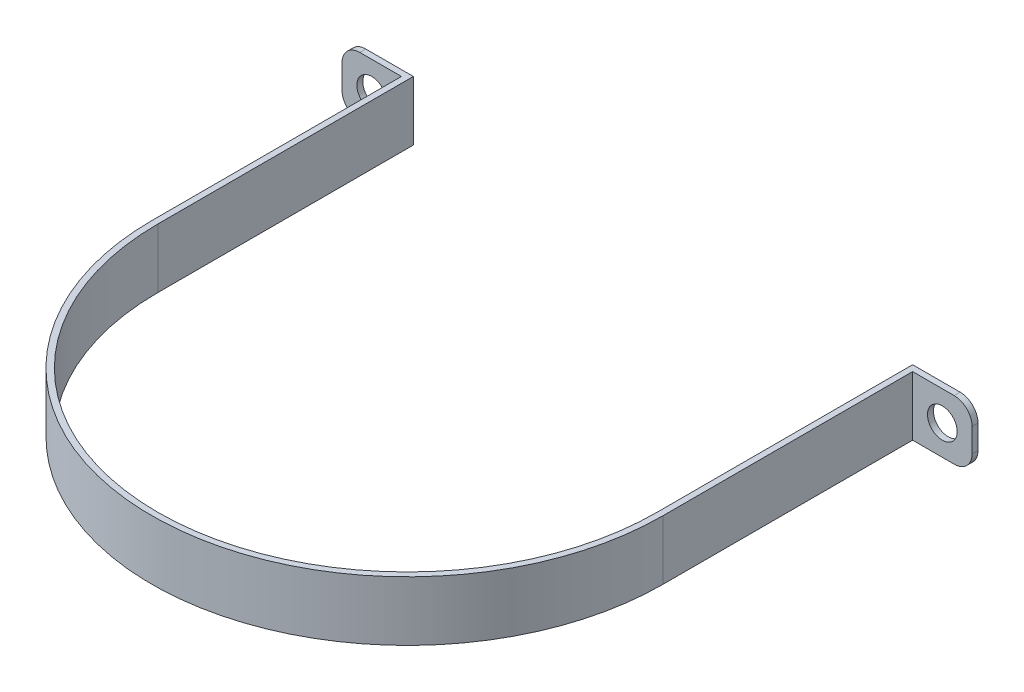
ISO-10303-21;
HEADER;
FILE_DESCRIPTION(('STEP AP214'),'2;1');
FILE_NAME('part.step','',(''),(''),'','','');
FILE_SCHEMA(('AUTOMOTIVE_DESIGN { 1 0 10303 214 1 1 1 1 }'));
ENDSEC;
DATA;
#1=APPLICATION_CONTEXT('core data for automotive mechanical design processes');
#2=APPLICATION_PROTOCOL_DEFINITION('international standard','automotive_design',2000,#1);
#3=PRODUCT_CONTEXT('',#1,'mechanical');
#4=PRODUCT('Part','Part','',(#3));
#5=PRODUCT_RELATED_PRODUCT_CATEGORY('part','',(#4));
#6=PRODUCT_DEFINITION_FORMATION('','',#4);
#7=PRODUCT_DEFINITION_CONTEXT('part definition',#1,'design');
#8=PRODUCT_DEFINITION('design','',#6,#7);
#9=PRODUCT_DEFINITION_SHAPE('','',#8);
#10=(LENGTH_UNIT() NAMED_UNIT(*) SI_UNIT(.MILLI.,.METRE.));
#11=(NAMED_UNIT(*) PLANE_ANGLE_UNIT() SI_UNIT($,.RADIAN.));
#12=(NAMED_UNIT(*) SI_UNIT($,.STERADIAN.) SOLID_ANGLE_UNIT());
#13=UNCERTAINTY_MEASURE_WITH_UNIT(LENGTH_MEASURE(1.E-05),#10,'distance_accuracy_value','');
#14=(GEOMETRIC_REPRESENTATION_CONTEXT(3) GLOBAL_UNCERTAINTY_ASSIGNED_CONTEXT((#13)) GLOBAL_UNIT_ASSIGNED_CONTEXT((#10,
#11,#12)) REPRESENTATION_CONTEXT('',''));
#15=CARTESIAN_POINT('',(0.,0.,0.));
#16=DIRECTION('',(0.,0.,1.));
#17=DIRECTION('',(1.,0.,0.));
#18=AXIS2_PLACEMENT_3D('',#15,#16,#17);
#19=CARTESIAN_POINT('',(-43.,10.,0.));
#20=DIRECTION('',(1.,0.,0.));
#21=DIRECTION('',(0.,0.,-1.));
#22=AXIS2_PLACEMENT_3D('',#19,#20,#21);
#23=PLANE('',#22);
#24=DIRECTION('',(0.,1.,0.));
#25=VECTOR('',#24,1.);
#26=CARTESIAN_POINT('',(-43.,10.,-42.));
#27=LINE('',#26,#25);
#28=CARTESIAN_POINT('',(-43.,0.,-42.));
#29=VERTEX_POINT('',#28);
#30=CARTESIAN_POINT('',(-43.,10.,-42.));
#31=VERTEX_POINT('',#30);
#32=EDGE_CURVE('E152',#29,#31,#27,.T.);
#33=ORIENTED_EDGE('',*,*,#32,.F.);
#34=DIRECTION('',(0.,0.,1.));
#35=VECTOR('',#34,1.);
#36=CARTESIAN_POINT('',(-43.,0.,0.));
#37=LINE('',#36,#35);
#38=CARTESIAN_POINT('',(-43.,0.,0.));
#39=VERTEX_POINT('',#38);
#40=EDGE_CURVE('E160',#29,#39,#37,.T.);
#41=ORIENTED_EDGE('',*,*,#40,.T.);
#42=DIRECTION('',(0.,-1.,0.));
#43=VECTOR('',#42,1.);
#44=CARTESIAN_POINT('',(-43.,10.,0.));
#45=LINE('',#44,#43);
#46=CARTESIAN_POINT('',(-43.,10.,0.));
#47=VERTEX_POINT('',#46);
#48=EDGE_CURVE('E239',#47,#39,#45,.T.);
#49=ORIENTED_EDGE('',*,*,#48,.F.);
#50=DIRECTION('',(0.,0.,1.));
#51=VECTOR('',#50,1.);
#52=CARTESIAN_POINT('',(-43.,10.,0.));
#53=LINE('',#52,#51);
#54=EDGE_CURVE('E169',#31,#47,#53,.T.);
#55=ORIENTED_EDGE('',*,*,#54,.F.);
#56=EDGE_LOOP('',(#33,#41,#49,#55));
#57=FACE_BOUND('',#56,.T.);
#58=ADVANCED_FACE('F34',(#57),#23,.F.);
#59=CARTESIAN_POINT('',(43.,10.,0.));
#60=DIRECTION('',(-1.,0.,0.));
#61=DIRECTION('',(0.,0.,1.));
#62=AXIS2_PLACEMENT_3D('',#59,#60,#61);
#63=PLANE('',#62);
#64=DIRECTION('',(0.,1.,0.));
#65=VECTOR('',#64,1.);
#66=CARTESIAN_POINT('',(43.,10.,-42.));
#67=LINE('',#66,#65);
#68=CARTESIAN_POINT('',(43.,0.,-42.));
#69=VERTEX_POINT('',#68);
#70=CARTESIAN_POINT('',(43.,10.,-42.));
#71=VERTEX_POINT('',#70);
#72=EDGE_CURVE('E189',#69,#71,#67,.T.);
#73=ORIENTED_EDGE('',*,*,#72,.T.);
#74=DIRECTION('',(0.,0.,-1.));
#75=VECTOR('',#74,1.);
#76=CARTESIAN_POINT('',(43.,10.,0.));
#77=LINE('',#76,#75);
#78=CARTESIAN_POINT('',(43.,10.,0.));
#79=VERTEX_POINT('',#78);
#80=EDGE_CURVE('E216',#79,#71,#77,.T.);
#81=ORIENTED_EDGE('',*,*,#80,.F.);
#82=DIRECTION('',(0.,-1.,0.));
#83=VECTOR('',#82,1.);
#84=CARTESIAN_POINT('',(43.,10.,0.));
#85=LINE('',#84,#83);
#86=CARTESIAN_POINT('',(43.,0.,0.));
#87=VERTEX_POINT('',#86);
#88=EDGE_CURVE('E236',#79,#87,#85,.T.);
#89=ORIENTED_EDGE('',*,*,#88,.T.);
#90=DIRECTION('',(0.,0.,-1.));
#91=VECTOR('',#90,1.);
#92=CARTESIAN_POINT('',(43.,0.,0.));
#93=LINE('',#92,#91);
#94=EDGE_CURVE('E230',#87,#69,#93,.T.);
#95=ORIENTED_EDGE('',*,*,#94,.T.);
#96=EDGE_LOOP('',(#73,#81,#89,#95));
#97=FACE_BOUND('',#96,.T.);
#98=ADVANCED_FACE('F326',(#97),#63,.F.);
#99=CARTESIAN_POINT('',(42.,10.,-43.));
#100=DIRECTION('',(1.,0.,0.));
#101=DIRECTION('',(0.,0.,-1.));
#102=AXIS2_PLACEMENT_3D('',#99,#100,#101);
#103=PLANE('',#102);
#104=DIRECTION('',(0.,0.,1.));
#105=VECTOR('',#104,1.);
#106=CARTESIAN_POINT('',(42.,0.,-43.));
#107=LINE('',#106,#105);
#108=CARTESIAN_POINT('',(42.,0.,-43.));
#109=VERTEX_POINT('',#108);
#110=CARTESIAN_POINT('',(42.,0.,0.));
#111=VERTEX_POINT('',#110);
#112=EDGE_CURVE('E199',#109,#111,#107,.T.);
#113=ORIENTED_EDGE('',*,*,#112,.T.);
#114=DIRECTION('',(0.,-1.,0.));
#115=VECTOR('',#114,1.);
#116=CARTESIAN_POINT('',(42.,10.,0.));
#117=LINE('',#116,#115);
#118=CARTESIAN_POINT('',(42.,10.,0.));
#119=VERTEX_POINT('',#118);
#120=EDGE_CURVE('E247',#119,#111,#117,.T.);
#121=ORIENTED_EDGE('',*,*,#120,.F.);
#122=DIRECTION('',(0.,0.,1.));
#123=VECTOR('',#122,1.);
#124=CARTESIAN_POINT('',(42.,10.,-43.));
#125=LINE('',#124,#123);
#126=CARTESIAN_POINT('',(42.,10.,-43.));
#127=VERTEX_POINT('',#126);
#128=EDGE_CURVE('E202',#127,#119,#125,.T.);
#129=ORIENTED_EDGE('',*,*,#128,.F.);
#130=DIRECTION('',(0.,-1.,0.));
#131=VECTOR('',#130,1.);
#132=CARTESIAN_POINT('',(42.,10.,-43.));
#133=LINE('',#132,#131);
#134=EDGE_CURVE('E221',#127,#109,#133,.T.);
#135=ORIENTED_EDGE('',*,*,#134,.T.);
#136=EDGE_LOOP('',(#113,#121,#129,#135));
#137=FACE_BOUND('',#136,.T.);
#138=ADVANCED_FACE('F296',(#137),#103,.F.);
#139=CARTESIAN_POINT('',(0.,10.,0.));
#140=DIRECTION('',(0.,-1.,0.));
#141=DIRECTION('',(0.,0.,-1.));
#142=AXIS2_PLACEMENT_3D('',#139,#140,#141);
#143=CYLINDRICAL_SURFACE('',#142,42.);
#144=CARTESIAN_POINT('',(0.,0.,0.));
#145=DIRECTION('',(0.,-1.,0.));
#146=DIRECTION('',(0.,0.,1.));
#147=AXIS2_PLACEMENT_3D('',#144,#145,#146);
#148=CIRCLE('',#147,42.);
#149=CARTESIAN_POINT('',(-42.,0.,0.));
#150=VERTEX_POINT('',#149);
#151=EDGE_CURVE('E224',#111,#150,#148,.T.);
#152=ORIENTED_EDGE('',*,*,#151,.T.);
#153=DIRECTION('',(0.,-1.,0.));
#154=VECTOR('',#153,1.);
#155=CARTESIAN_POINT('',(-42.,10.,0.));
#156=LINE('',#155,#154);
#157=CARTESIAN_POINT('',(-42.,10.,0.));
#158=VERTEX_POINT('',#157);
#159=EDGE_CURVE('E244',#158,#150,#156,.T.);
#160=ORIENTED_EDGE('',*,*,#159,.F.);
#161=CARTESIAN_POINT('',(0.,10.,0.));
#162=DIRECTION('',(0.,-1.,0.));
#163=DIRECTION('',(0.,0.,1.));
#164=AXIS2_PLACEMENT_3D('',#161,#162,#163);
#165=CIRCLE('',#164,42.);
#166=EDGE_CURVE('E205',#119,#158,#165,.T.);
#167=ORIENTED_EDGE('',*,*,#166,.F.);
#168=ORIENTED_EDGE('',*,*,#120,.T.);
#169=EDGE_LOOP('',(#152,#160,#167,#168));
#170=FACE_BOUND('',#169,.T.);
#171=ADVANCED_FACE('F293',(#170),#143,.F.);
#172=CARTESIAN_POINT('',(-42.,10.,0.));
#173=DIRECTION('',(-1.,0.,0.));
#174=DIRECTION('',(0.,0.,1.));
#175=AXIS2_PLACEMENT_3D('',#172,#173,#174);
#176=PLANE('',#175);
#177=DIRECTION('',(0.,0.,-1.));
#178=VECTOR('',#177,1.);
#179=CARTESIAN_POINT('',(-42.,0.,0.));
#180=LINE('',#179,#178);
#181=CARTESIAN_POINT('',(-42.,0.,-43.));
#182=VERTEX_POINT('',#181);
#183=EDGE_CURVE('E226',#150,#182,#180,.T.);
#184=ORIENTED_EDGE('',*,*,#183,.T.);
#185=DIRECTION('',(0.,-1.,0.));
#186=VECTOR('',#185,1.);
#187=CARTESIAN_POINT('',(-42.,10.,-43.));
#188=LINE('',#187,#186);
#189=CARTESIAN_POINT('',(-42.,10.,-43.));
#190=VERTEX_POINT('',#189);
#191=EDGE_CURVE('E241',#190,#182,#188,.T.);
#192=ORIENTED_EDGE('',*,*,#191,.F.);
#193=DIRECTION('',(0.,0.,-1.));
#194=VECTOR('',#193,1.);
#195=CARTESIAN_POINT('',(-42.,10.,0.));
#196=LINE('',#195,#194);
#197=EDGE_CURVE('E208',#158,#190,#196,.T.);
#198=ORIENTED_EDGE('',*,*,#197,.F.);
#199=ORIENTED_EDGE('',*,*,#159,.T.);
#200=EDGE_LOOP('',(#184,#192,#198,#199));
#201=FACE_BOUND('',#200,.T.);
#202=ADVANCED_FACE('F287',(#201),#176,.F.);
#203=CARTESIAN_POINT('',(-43.,10.,-43.));
#204=DIRECTION('',(0.,0.,1.));
#205=DIRECTION('',(1.,0.,0.));
#206=AXIS2_PLACEMENT_3D('',#203,#204,#205);
#207=PLANE('',#206);
#208=CARTESIAN_POINT('',(-48.,5.,-43.));
#209=DIRECTION('',(0.,0.,1.));
#210=DIRECTION('',(1.,0.,0.));
#211=AXIS2_PLACEMENT_3D('',#208,#209,#210);
#212=CIRCLE('',#211,2.5);
#213=CARTESIAN_POINT('',(-45.5,5.,-43.));
#214=VERTEX_POINT('',#213);
#215=EDGE_CURVE('E176',#214,#214,#212,.T.);
#216=ORIENTED_EDGE('',*,*,#215,.T.);
#217=EDGE_LOOP('',(#216));
#218=FACE_BOUND('',#217,.T.);
#219=DIRECTION('',(-1.,0.,0.));
#220=VECTOR('',#219,1.);
#221=CARTESIAN_POINT('',(-43.,0.,-43.));
#222=LINE('',#221,#220);
#223=CARTESIAN_POINT('',(-50.,0.,-43.));
#224=VERTEX_POINT('',#223);
#225=EDGE_CURVE('E167',#182,#224,#222,.T.);
#226=ORIENTED_EDGE('',*,*,#225,.T.);
#227=CARTESIAN_POINT('',(-50.,3.,-43.));
#228=DIRECTION('',(0.,0.,1.));
#229=DIRECTION('',(1.,0.,0.));
#230=AXIS2_PLACEMENT_3D('',#227,#228,#229);
#231=CIRCLE('',#230,3.);
#232=CARTESIAN_POINT('',(-53.,3.,-43.));
#233=VERTEX_POINT('',#232);
#234=EDGE_CURVE('E56',#224,#233,#231,.F.);
#235=ORIENTED_EDGE('',*,*,#234,.T.);
#236=DIRECTION('',(0.,-1.,0.));
#237=VECTOR('',#236,1.);
#238=CARTESIAN_POINT('',(-53.,10.,-43.));
#239=LINE('',#238,#237);
#240=CARTESIAN_POINT('',(-53.,7.,-43.));
#241=VERTEX_POINT('',#240);
#242=EDGE_CURVE('E171',#241,#233,#239,.T.);
#243=ORIENTED_EDGE('',*,*,#242,.F.);
#244=CARTESIAN_POINT('',(-50.,7.,-43.));
#245=DIRECTION('',(0.,0.,1.));
#246=DIRECTION('',(1.,0.,0.));
#247=AXIS2_PLACEMENT_3D('',#244,#245,#246);
#248=CIRCLE('',#247,3.);
#249=CARTESIAN_POINT('',(-50.,10.,-43.));
#250=VERTEX_POINT('',#249);
#251=EDGE_CURVE('E271',#241,#250,#248,.F.);
#252=ORIENTED_EDGE('',*,*,#251,.T.);
#253=DIRECTION('',(-1.,0.,0.));
#254=VECTOR('',#253,1.);
#255=CARTESIAN_POINT('',(-43.,10.,-43.));
#256=LINE('',#255,#254);
#257=EDGE_CURVE('E210',#190,#250,#256,.T.);
#258=ORIENTED_EDGE('',*,*,#257,.F.);
#259=ORIENTED_EDGE('',*,*,#191,.T.);
#260=EDGE_LOOP('',(#226,#235,#243,#252,#258,#259));
#261=FACE_BOUND('',#260,.T.);
#262=ADVANCED_FACE('F282',(#218,#261),#207,.F.);
#263=CARTESIAN_POINT('',(0.,10.,0.));
#264=DIRECTION('',(0.,-1.,0.));
#265=DIRECTION('',(0.,0.,-1.));
#266=AXIS2_PLACEMENT_3D('',#263,#264,#265);
#267=CYLINDRICAL_SURFACE('',#266,43.);
#268=CARTESIAN_POINT('',(0.,0.,0.));
#269=DIRECTION('',(0.,1.,0.));
#270=DIRECTION('',(0.,0.,1.));
#271=AXIS2_PLACEMENT_3D('',#268,#269,#270);
#272=CIRCLE('',#271,43.);
#273=EDGE_CURVE('E163',#39,#87,#272,.T.);
#274=ORIENTED_EDGE('',*,*,#273,.T.);
#275=ORIENTED_EDGE('',*,*,#88,.F.);
#276=CARTESIAN_POINT('',(0.,10.,0.));
#277=DIRECTION('',(0.,1.,0.));
#278=DIRECTION('',(0.,0.,1.));
#279=AXIS2_PLACEMENT_3D('',#276,#277,#278);
#280=CIRCLE('',#279,43.);
#281=EDGE_CURVE('E214',#47,#79,#280,.T.);
#282=ORIENTED_EDGE('',*,*,#281,.F.);
#283=ORIENTED_EDGE('',*,*,#48,.T.);
#284=EDGE_LOOP('',(#274,#275,#282,#283));
#285=FACE_BOUND('',#284,.T.);
#286=ADVANCED_FACE('F328',(#285),#267,.T.);
#287=CARTESIAN_POINT('',(42.,10.,-43.));
#288=DIRECTION('',(0.,0.,1.));
#289=DIRECTION('',(1.,0.,0.));
#290=AXIS2_PLACEMENT_3D('',#287,#288,#289);
#291=PLANE('',#290);
#292=CARTESIAN_POINT('',(48.,5.,-43.));
#293=DIRECTION('',(0.,0.,-1.));
#294=DIRECTION('',(-1.,0.,0.));
#295=AXIS2_PLACEMENT_3D('',#292,#293,#294);
#296=CIRCLE('',#295,2.5);
#297=CARTESIAN_POINT('',(45.5,5.,-43.));
#298=VERTEX_POINT('',#297);
#299=EDGE_CURVE('E181',#298,#298,#296,.T.);
#300=ORIENTED_EDGE('',*,*,#299,.F.);
#301=EDGE_LOOP('',(#300));
#302=FACE_BOUND('',#301,.T.);
#303=DIRECTION('',(0.,-1.,0.));
#304=VECTOR('',#303,1.);
#305=CARTESIAN_POINT('',(53.,10.,-43.));
#306=LINE('',#305,#304);
#307=CARTESIAN_POINT('',(53.,7.,-43.));
#308=VERTEX_POINT('',#307);
#309=CARTESIAN_POINT('',(53.,3.,-43.));
#310=VERTEX_POINT('',#309);
#311=EDGE_CURVE('E186',#308,#310,#306,.T.);
#312=ORIENTED_EDGE('',*,*,#311,.T.);
#313=CARTESIAN_POINT('',(50.,3.,-43.));
#314=DIRECTION('',(0.,0.,1.));
#315=DIRECTION('',(1.,0.,0.));
#316=AXIS2_PLACEMENT_3D('',#313,#314,#315);
#317=CIRCLE('',#316,3.);
#318=CARTESIAN_POINT('',(50.,0.,-43.));
#319=VERTEX_POINT('',#318);
#320=EDGE_CURVE('E262',#310,#319,#317,.F.);
#321=ORIENTED_EDGE('',*,*,#320,.T.);
#322=DIRECTION('',(-1.,0.,0.));
#323=VECTOR('',#322,1.);
#324=CARTESIAN_POINT('',(42.,0.,-43.));
#325=LINE('',#324,#323);
#326=EDGE_CURVE('E206',#319,#109,#325,.T.);
#327=ORIENTED_EDGE('',*,*,#326,.T.);
#328=ORIENTED_EDGE('',*,*,#134,.F.);
#329=DIRECTION('',(-1.,0.,0.));
#330=VECTOR('',#329,1.);
#331=CARTESIAN_POINT('',(42.,10.,-43.));
#332=LINE('',#331,#330);
#333=CARTESIAN_POINT('',(50.,10.,-43.));
#334=VERTEX_POINT('',#333);
#335=EDGE_CURVE('E219',#334,#127,#332,.T.);
#336=ORIENTED_EDGE('',*,*,#335,.F.);
#337=CARTESIAN_POINT('',(50.,7.,-43.));
#338=DIRECTION('',(0.,0.,1.));
#339=DIRECTION('',(1.,0.,0.));
#340=AXIS2_PLACEMENT_3D('',#337,#338,#339);
#341=CIRCLE('',#340,3.);
#342=EDGE_CURVE('E253',#334,#308,#341,.F.);
#343=ORIENTED_EDGE('',*,*,#342,.T.);
#344=EDGE_LOOP('',(#312,#321,#327,#328,#336,#343));
#345=FACE_BOUND('',#344,.T.);
#346=ADVANCED_FACE('F300',(#302,#345),#291,.F.);
#347=CARTESIAN_POINT('',(0.,10.,0.));
#348=DIRECTION('',(0.,1.,0.));
#349=DIRECTION('',(0.,0.,1.));
#350=AXIS2_PLACEMENT_3D('',#347,#348,#349);
#351=PLANE('',#350);
#352=ORIENTED_EDGE('',*,*,#257,.T.);
#353=DIRECTION('',(0.,0.,-1.));
#354=VECTOR('',#353,1.);
#355=CARTESIAN_POINT('',(-50.,10.,-42.));
#356=LINE('',#355,#354);
#357=CARTESIAN_POINT('',(-50.,10.,-42.));
#358=VERTEX_POINT('',#357);
#359=EDGE_CURVE('E273',#250,#358,#356,.F.);
#360=ORIENTED_EDGE('',*,*,#359,.T.);
#361=DIRECTION('',(-1.,0.,0.));
#362=VECTOR('',#361,1.);
#363=CARTESIAN_POINT('',(-43.,10.,-42.));
#364=LINE('',#363,#362);
#365=EDGE_CURVE('E180',#31,#358,#364,.T.);
#366=ORIENTED_EDGE('',*,*,#365,.F.);
#367=ORIENTED_EDGE('',*,*,#54,.T.);
#368=ORIENTED_EDGE('',*,*,#281,.T.);
#369=ORIENTED_EDGE('',*,*,#80,.T.);
#370=DIRECTION('',(1.,0.,0.));
#371=VECTOR('',#370,1.);
#372=CARTESIAN_POINT('',(43.,10.,-42.));
#373=LINE('',#372,#371);
#374=CARTESIAN_POINT('',(50.,10.,-42.));
#375=VERTEX_POINT('',#374);
#376=EDGE_CURVE('E191',#71,#375,#373,.T.);
#377=ORIENTED_EDGE('',*,*,#376,.T.);
#378=DIRECTION('',(0.,0.,-1.));
#379=VECTOR('',#378,1.);
#380=CARTESIAN_POINT('',(50.,10.,0.));
#381=LINE('',#380,#379);
#382=EDGE_CURVE('E250',#375,#334,#381,.T.);
#383=ORIENTED_EDGE('',*,*,#382,.T.);
#384=ORIENTED_EDGE('',*,*,#335,.T.);
#385=ORIENTED_EDGE('',*,*,#128,.T.);
#386=ORIENTED_EDGE('',*,*,#166,.T.);
#387=ORIENTED_EDGE('',*,*,#197,.T.);
#388=EDGE_LOOP('',(#352,#360,#366,#367,#368,#369,#377,#383,#384,#385,#386,#387));
#389=FACE_BOUND('',#388,.T.);
#390=ADVANCED_FACE('F321',(#389),#351,.T.);
#391=CARTESIAN_POINT('',(0.,0.,0.));
#392=DIRECTION('',(0.,1.,0.));
#393=DIRECTION('',(0.,0.,1.));
#394=AXIS2_PLACEMENT_3D('',#391,#392,#393);
#395=PLANE('',#394);
#396=DIRECTION('',(1.,0.,0.));
#397=VECTOR('',#396,1.);
#398=CARTESIAN_POINT('',(-53.,0.,-42.));
#399=LINE('',#398,#397);
#400=CARTESIAN_POINT('',(-50.,0.,-42.));
#401=VERTEX_POINT('',#400);
#402=EDGE_CURVE('E147',#401,#29,#399,.T.);
#403=ORIENTED_EDGE('',*,*,#402,.F.);
#404=DIRECTION('',(0.,0.,-1.));
#405=VECTOR('',#404,1.);
#406=CARTESIAN_POINT('',(-50.,0.,0.));
#407=LINE('',#406,#405);
#408=EDGE_CURVE('E277',#401,#224,#407,.T.);
#409=ORIENTED_EDGE('',*,*,#408,.T.);
#410=ORIENTED_EDGE('',*,*,#225,.F.);
#411=ORIENTED_EDGE('',*,*,#183,.F.);
#412=ORIENTED_EDGE('',*,*,#151,.F.);
#413=ORIENTED_EDGE('',*,*,#112,.F.);
#414=ORIENTED_EDGE('',*,*,#326,.F.);
#415=DIRECTION('',(0.,0.,-1.));
#416=VECTOR('',#415,1.);
#417=CARTESIAN_POINT('',(50.,0.,-42.));
#418=LINE('',#417,#416);
#419=CARTESIAN_POINT('',(50.,0.,-42.));
#420=VERTEX_POINT('',#419);
#421=EDGE_CURVE('E264',#319,#420,#418,.F.);
#422=ORIENTED_EDGE('',*,*,#421,.T.);
#423=DIRECTION('',(-1.,0.,0.));
#424=VECTOR('',#423,1.);
#425=CARTESIAN_POINT('',(53.,0.,-42.));
#426=LINE('',#425,#424);
#427=EDGE_CURVE('E197',#420,#69,#426,.T.);
#428=ORIENTED_EDGE('',*,*,#427,.T.);
#429=ORIENTED_EDGE('',*,*,#94,.F.);
#430=ORIENTED_EDGE('',*,*,#273,.F.);
#431=ORIENTED_EDGE('',*,*,#40,.F.);
#432=EDGE_LOOP('',(#403,#409,#410,#411,#412,#413,#414,#422,#428,#429,#430,#431));
#433=FACE_BOUND('',#432,.T.);
#434=ADVANCED_FACE('F161',(#433),#395,.F.);
#435=CARTESIAN_POINT('',(53.,10.,-42.));
#436=DIRECTION('',(1.,0.,0.));
#437=DIRECTION('',(0.,0.,-1.));
#438=AXIS2_PLACEMENT_3D('',#435,#436,#437);
#439=PLANE('',#438);
#440=DIRECTION('',(0.,-1.,0.));
#441=VECTOR('',#440,1.);
#442=CARTESIAN_POINT('',(53.,10.,-42.));
#443=LINE('',#442,#441);
#444=CARTESIAN_POINT('',(53.,7.,-42.));
#445=VERTEX_POINT('',#444);
#446=CARTESIAN_POINT('',(53.,3.,-42.));
#447=VERTEX_POINT('',#446);
#448=EDGE_CURVE('E194',#445,#447,#443,.T.);
#449=ORIENTED_EDGE('',*,*,#448,.T.);
#450=DIRECTION('',(0.,0.,-1.));
#451=VECTOR('',#450,1.);
#452=CARTESIAN_POINT('',(53.,3.,-43.));
#453=LINE('',#452,#451);
#454=EDGE_CURVE('E259',#447,#310,#453,.T.);
#455=ORIENTED_EDGE('',*,*,#454,.T.);
#456=ORIENTED_EDGE('',*,*,#311,.F.);
#457=DIRECTION('',(0.,0.,-1.));
#458=VECTOR('',#457,1.);
#459=CARTESIAN_POINT('',(53.,7.,-42.));
#460=LINE('',#459,#458);
#461=EDGE_CURVE('E255',#308,#445,#460,.F.);
#462=ORIENTED_EDGE('',*,*,#461,.T.);
#463=EDGE_LOOP('',(#449,#455,#456,#462));
#464=FACE_BOUND('',#463,.T.);
#465=ADVANCED_FACE('F313',(#464),#439,.T.);
#466=CARTESIAN_POINT('',(0.,0.,-42.));
#467=DIRECTION('',(0.,0.,-1.));
#468=DIRECTION('',(-1.,0.,0.));
#469=AXIS2_PLACEMENT_3D('',#466,#467,#468);
#470=PLANE('',#469);
#471=CARTESIAN_POINT('',(48.,5.,-42.));
#472=DIRECTION('',(0.,0.,-1.));
#473=DIRECTION('',(-1.,0.,0.));
#474=AXIS2_PLACEMENT_3D('',#471,#472,#473);
#475=CIRCLE('',#474,2.5);
#476=CARTESIAN_POINT('',(45.5,5.,-42.));
#477=VERTEX_POINT('',#476);
#478=EDGE_CURVE('E183',#477,#477,#475,.T.);
#479=ORIENTED_EDGE('',*,*,#478,.T.);
#480=EDGE_LOOP('',(#479));
#481=FACE_BOUND('',#480,.T.);
#482=ORIENTED_EDGE('',*,*,#427,.F.);
#483=CARTESIAN_POINT('',(50.,3.,-42.));
#484=DIRECTION('',(0.,0.,-1.));
#485=DIRECTION('',(-1.,0.,0.));
#486=AXIS2_PLACEMENT_3D('',#483,#484,#485);
#487=CIRCLE('',#486,3.);
#488=EDGE_CURVE('E266',#420,#447,#487,.F.);
#489=ORIENTED_EDGE('',*,*,#488,.T.);
#490=ORIENTED_EDGE('',*,*,#448,.F.);
#491=CARTESIAN_POINT('',(50.,7.,-42.));
#492=DIRECTION('',(0.,0.,-1.));
#493=DIRECTION('',(-1.,0.,0.));
#494=AXIS2_PLACEMENT_3D('',#491,#492,#493);
#495=CIRCLE('',#494,3.);
#496=EDGE_CURVE('E257',#445,#375,#495,.F.);
#497=ORIENTED_EDGE('',*,*,#496,.T.);
#498=ORIENTED_EDGE('',*,*,#376,.F.);
#499=ORIENTED_EDGE('',*,*,#72,.F.);
#500=EDGE_LOOP('',(#482,#489,#490,#497,#498,#499));
#501=FACE_BOUND('',#500,.T.);
#502=ADVANCED_FACE('F309',(#481,#501),#470,.F.);
#503=CARTESIAN_POINT('',(50.,7.,0.));
#504=DIRECTION('',(0.,0.,-1.));
#505=DIRECTION('',(-1.,0.,0.));
#506=AXIS2_PLACEMENT_3D('',#503,#504,#505);
#507=CYLINDRICAL_SURFACE('',#506,3.);
#508=ORIENTED_EDGE('',*,*,#496,.F.);
#509=ORIENTED_EDGE('',*,*,#461,.F.);
#510=ORIENTED_EDGE('',*,*,#342,.F.);
#511=ORIENTED_EDGE('',*,*,#382,.F.);
#512=EDGE_LOOP('',(#508,#509,#510,#511));
#513=FACE_BOUND('',#512,.T.);
#514=ADVANCED_FACE('F317',(#513),#507,.T.);
#515=CARTESIAN_POINT('',(50.,3.,-42.));
#516=DIRECTION('',(0.,0.,1.));
#517=DIRECTION('',(1.,0.,0.));
#518=AXIS2_PLACEMENT_3D('',#515,#516,#517);
#519=CYLINDRICAL_SURFACE('',#518,3.);
#520=ORIENTED_EDGE('',*,*,#488,.F.);
#521=ORIENTED_EDGE('',*,*,#421,.F.);
#522=ORIENTED_EDGE('',*,*,#320,.F.);
#523=ORIENTED_EDGE('',*,*,#454,.F.);
#524=EDGE_LOOP('',(#520,#521,#522,#523));
#525=FACE_BOUND('',#524,.T.);
#526=ADVANCED_FACE('F305',(#525),#519,.T.);
#527=CARTESIAN_POINT('',(48.,5.,-42.));
#528=DIRECTION('',(0.,0.,-1.));
#529=DIRECTION('',(-1.,0.,0.));
#530=AXIS2_PLACEMENT_3D('',#527,#528,#529);
#531=CYLINDRICAL_SURFACE('',#530,2.5);
#532=ORIENTED_EDGE('',*,*,#478,.F.);
#533=EDGE_LOOP('',(#532));
#534=FACE_BOUND('',#533,.T.);
#535=ORIENTED_EDGE('',*,*,#299,.T.);
#536=EDGE_LOOP('',(#535));
#537=FACE_BOUND('',#536,.T.);
#538=ADVANCED_FACE('F355',(#534,#537),#531,.F.);
#539=CARTESIAN_POINT('',(-53.,10.,-42.));
#540=DIRECTION('',(1.,0.,0.));
#541=DIRECTION('',(0.,0.,-1.));
#542=AXIS2_PLACEMENT_3D('',#539,#540,#541);
#543=PLANE('',#542);
#544=ORIENTED_EDGE('',*,*,#242,.T.);
#545=DIRECTION('',(0.,0.,-1.));
#546=VECTOR('',#545,1.);
#547=CARTESIAN_POINT('',(-53.,3.,-42.));
#548=LINE('',#547,#546);
#549=CARTESIAN_POINT('',(-53.,3.,-42.));
#550=VERTEX_POINT('',#549);
#551=EDGE_CURVE('E42',#233,#550,#548,.F.);
#552=ORIENTED_EDGE('',*,*,#551,.T.);
#553=DIRECTION('',(0.,-1.,0.));
#554=VECTOR('',#553,1.);
#555=CARTESIAN_POINT('',(-53.,10.,-42.));
#556=LINE('',#555,#554);
#557=CARTESIAN_POINT('',(-53.,7.,-42.));
#558=VERTEX_POINT('',#557);
#559=EDGE_CURVE('E157',#558,#550,#556,.T.);
#560=ORIENTED_EDGE('',*,*,#559,.F.);
#561=DIRECTION('',(0.,0.,-1.));
#562=VECTOR('',#561,1.);
#563=CARTESIAN_POINT('',(-53.,7.,-43.));
#564=LINE('',#563,#562);
#565=EDGE_CURVE('E268',#558,#241,#564,.T.);
#566=ORIENTED_EDGE('',*,*,#565,.T.);
#567=EDGE_LOOP('',(#544,#552,#560,#566));
#568=FACE_BOUND('',#567,.T.);
#569=ADVANCED_FACE('F364',(#568),#543,.F.);
#570=CARTESIAN_POINT('',(0.,0.,-42.));
#571=DIRECTION('',(0.,0.,-1.));
#572=DIRECTION('',(1.,0.,0.));
#573=AXIS2_PLACEMENT_3D('',#570,#571,#572);
#574=PLANE('',#573);
#575=CARTESIAN_POINT('',(-48.,5.,-42.));
#576=DIRECTION('',(0.,0.,1.));
#577=DIRECTION('',(1.,0.,0.));
#578=AXIS2_PLACEMENT_3D('',#575,#576,#577);
#579=CIRCLE('',#578,2.5);
#580=CARTESIAN_POINT('',(-45.5,5.,-42.));
#581=VERTEX_POINT('',#580);
#582=EDGE_CURVE('E173',#581,#581,#579,.T.);
#583=ORIENTED_EDGE('',*,*,#582,.F.);
#584=EDGE_LOOP('',(#583));
#585=FACE_BOUND('',#584,.T.);
#586=ORIENTED_EDGE('',*,*,#559,.T.);
#587=CARTESIAN_POINT('',(-50.,3.,-42.));
#588=DIRECTION('',(0.,0.,-1.));
#589=DIRECTION('',(-1.,0.,0.));
#590=AXIS2_PLACEMENT_3D('',#587,#588,#589);
#591=CIRCLE('',#590,3.);
#592=EDGE_CURVE('E11',#550,#401,#591,.F.);
#593=ORIENTED_EDGE('',*,*,#592,.T.);
#594=ORIENTED_EDGE('',*,*,#402,.T.);
#595=ORIENTED_EDGE('',*,*,#32,.T.);
#596=ORIENTED_EDGE('',*,*,#365,.T.);
#597=CARTESIAN_POINT('',(-50.,7.,-42.));
#598=DIRECTION('',(0.,0.,-1.));
#599=DIRECTION('',(-1.,0.,0.));
#600=AXIS2_PLACEMENT_3D('',#597,#598,#599);
#601=CIRCLE('',#600,3.);
#602=EDGE_CURVE('E275',#358,#558,#601,.F.);
#603=ORIENTED_EDGE('',*,*,#602,.T.);
#604=EDGE_LOOP('',(#586,#593,#594,#595,#596,#603));
#605=FACE_BOUND('',#604,.T.);
#606=ADVANCED_FACE('F149',(#585,#605),#574,.F.);
#607=CARTESIAN_POINT('',(-50.,7.,-42.));
#608=DIRECTION('',(0.,0.,1.));
#609=DIRECTION('',(1.,0.,0.));
#610=AXIS2_PLACEMENT_3D('',#607,#608,#609);
#611=CYLINDRICAL_SURFACE('',#610,3.);
#612=ORIENTED_EDGE('',*,*,#602,.F.);
#613=ORIENTED_EDGE('',*,*,#359,.F.);
#614=ORIENTED_EDGE('',*,*,#251,.F.);
#615=ORIENTED_EDGE('',*,*,#565,.F.);
#616=EDGE_LOOP('',(#612,#613,#614,#615));
#617=FACE_BOUND('',#616,.T.);
#618=ADVANCED_FACE('F356',(#617),#611,.T.);
#619=CARTESIAN_POINT('',(-50.,3.,0.));
#620=DIRECTION('',(0.,0.,-1.));
#621=DIRECTION('',(-1.,0.,0.));
#622=AXIS2_PLACEMENT_3D('',#619,#620,#621);
#623=CYLINDRICAL_SURFACE('',#622,3.);
#624=ORIENTED_EDGE('',*,*,#592,.F.);
#625=ORIENTED_EDGE('',*,*,#551,.F.);
#626=ORIENTED_EDGE('',*,*,#234,.F.);
#627=ORIENTED_EDGE('',*,*,#408,.F.);
#628=EDGE_LOOP('',(#624,#625,#626,#627));
#629=FACE_BOUND('',#628,.T.);
#630=ADVANCED_FACE('F36',(#629),#623,.T.);
#631=CARTESIAN_POINT('',(-48.,5.,-42.));
#632=DIRECTION('',(0.,0.,-1.));
#633=DIRECTION('',(-1.,0.,0.));
#634=AXIS2_PLACEMENT_3D('',#631,#632,#633);
#635=CYLINDRICAL_SURFACE('',#634,2.5);
#636=ORIENTED_EDGE('',*,*,#582,.T.);
#637=EDGE_LOOP('',(#636));
#638=FACE_BOUND('',#637,.T.);
#639=ORIENTED_EDGE('',*,*,#215,.F.);
#640=EDGE_LOOP('',(#639));
#641=FACE_BOUND('',#640,.T.);
#642=ADVANCED_FACE('F363',(#638,#641),#635,.F.);
#643=CLOSED_SHELL('',(#58,#98,#138,#171,#202,#262,#286,#346,#390,#434,#465,#502,#514,#526,#538,
#569,#606,#618,#630,#642));
#644=MANIFOLD_SOLID_BREP('B2',#643);
#645=ADVANCED_BREP_SHAPE_REPRESENTATION('',(#18,#644),#14);
#646=SHAPE_DEFINITION_REPRESENTATION(#9,#645);
ENDSEC;
END-ISO-10303-21;
